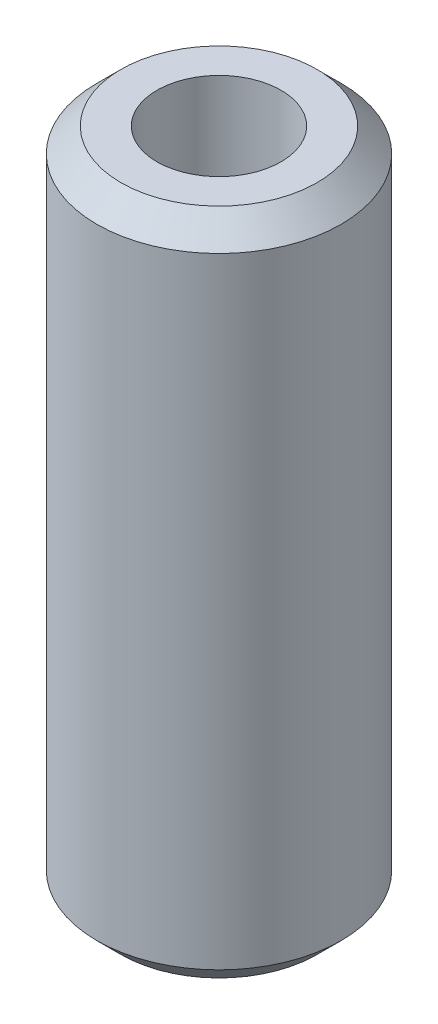
ISO-10303-21;
HEADER;
FILE_DESCRIPTION(('STEP AP214'),'2;1');
FILE_NAME('part.step','',(''),(''),'','','');
FILE_SCHEMA(('AUTOMOTIVE_DESIGN { 1 0 10303 214 1 1 1 1 }'));
ENDSEC;
DATA;
#1=APPLICATION_CONTEXT('core data for automotive mechanical design processes');
#2=APPLICATION_PROTOCOL_DEFINITION('international standard','automotive_design',2000,#1);
#3=PRODUCT_CONTEXT('',#1,'mechanical');
#4=PRODUCT('Part','Part','',(#3));
#5=PRODUCT_RELATED_PRODUCT_CATEGORY('part','',(#4));
#6=PRODUCT_DEFINITION_FORMATION('','',#4);
#7=PRODUCT_DEFINITION_CONTEXT('part definition',#1,'design');
#8=PRODUCT_DEFINITION('design','',#6,#7);
#9=PRODUCT_DEFINITION_SHAPE('','',#8);
#10=(LENGTH_UNIT() NAMED_UNIT(*) SI_UNIT(.MILLI.,.METRE.));
#11=(NAMED_UNIT(*) PLANE_ANGLE_UNIT() SI_UNIT($,.RADIAN.));
#12=(NAMED_UNIT(*) SI_UNIT($,.STERADIAN.) SOLID_ANGLE_UNIT());
#13=UNCERTAINTY_MEASURE_WITH_UNIT(LENGTH_MEASURE(1.E-05),#10,'distance_accuracy_value','');
#14=(GEOMETRIC_REPRESENTATION_CONTEXT(3) GLOBAL_UNCERTAINTY_ASSIGNED_CONTEXT((#13)) GLOBAL_UNIT_ASSIGNED_CONTEXT((#10,
#11,#12)) REPRESENTATION_CONTEXT('',''));
#15=CARTESIAN_POINT('',(0.,0.,0.));
#16=DIRECTION('',(0.,0.,1.));
#17=DIRECTION('',(1.,0.,0.));
#18=AXIS2_PLACEMENT_3D('',#15,#16,#17);
#19=CARTESIAN_POINT('',(0.,32.25,0.));
#20=DIRECTION('',(0.,-1.,0.));
#21=DIRECTION('',(0.,0.,-1.));
#22=AXIS2_PLACEMENT_3D('',#19,#20,#21);
#23=CONICAL_SURFACE('',#22,12.7,0.785398163397442);
#24=CARTESIAN_POINT('',(0.,34.75,0.));
#25=DIRECTION('',(0.,1.,0.));
#26=DIRECTION('',(0.,0.,1.));
#27=AXIS2_PLACEMENT_3D('',#24,#25,#26);
#28=CIRCLE('',#27,10.2);
#29=CARTESIAN_POINT('',(0.,34.75,10.2));
#30=VERTEX_POINT('',#29);
#31=EDGE_CURVE('E10',#30,#30,#28,.T.);
#32=ORIENTED_EDGE('',*,*,#31,.F.);
#33=EDGE_LOOP('',(#32));
#34=FACE_BOUND('',#33,.T.);
#35=CARTESIAN_POINT('',(0.,32.25,0.));
#36=DIRECTION('',(0.,1.,0.));
#37=DIRECTION('',(0.,0.,1.));
#38=AXIS2_PLACEMENT_3D('',#35,#36,#37);
#39=CIRCLE('',#38,12.7);
#40=CARTESIAN_POINT('',(0.,32.25,12.7));
#41=VERTEX_POINT('',#40);
#42=EDGE_CURVE('E57',#41,#41,#39,.T.);
#43=ORIENTED_EDGE('',*,*,#42,.T.);
#44=EDGE_LOOP('',(#43));
#45=FACE_BOUND('',#44,.T.);
#46=ADVANCED_FACE('F35',(#34,#45),#23,.T.);
#47=CARTESIAN_POINT('',(10.2,34.75,0.));
#48=DIRECTION('',(0.,-1.,0.));
#49=DIRECTION('',(0.,0.,-1.));
#50=AXIS2_PLACEMENT_3D('',#47,#48,#49);
#51=PLANE('',#50);
#52=CARTESIAN_POINT('',(0.,34.75,0.));
#53=DIRECTION('',(0.,1.,0.));
#54=DIRECTION('',(0.,0.,1.));
#55=AXIS2_PLACEMENT_3D('',#52,#53,#54);
#56=CIRCLE('',#55,6.45000000000001);
#57=CARTESIAN_POINT('',(0.,34.75,6.45000000000001));
#58=VERTEX_POINT('',#57);
#59=EDGE_CURVE('E41',#58,#58,#56,.T.);
#60=ORIENTED_EDGE('',*,*,#59,.F.);
#61=EDGE_LOOP('',(#60));
#62=FACE_BOUND('',#61,.T.);
#63=ORIENTED_EDGE('',*,*,#31,.T.);
#64=EDGE_LOOP('',(#63));
#65=FACE_BOUND('',#64,.T.);
#66=ADVANCED_FACE('F82',(#62,#65),#51,.F.);
#67=CARTESIAN_POINT('',(0.,78.808165711308,0.));
#68=DIRECTION('',(0.,1.,0.));
#69=DIRECTION('',(0.,0.,1.));
#70=AXIS2_PLACEMENT_3D('',#67,#68,#69);
#71=CYLINDRICAL_SURFACE('',#70,6.45000000000001);
#72=CARTESIAN_POINT('',(0.,-34.75,0.));
#73=DIRECTION('',(0.,1.,0.));
#74=DIRECTION('',(0.,0.,1.));
#75=AXIS2_PLACEMENT_3D('',#72,#73,#74);
#76=CIRCLE('',#75,6.45000000000001);
#77=CARTESIAN_POINT('',(0.,-34.75,6.45000000000001));
#78=VERTEX_POINT('',#77);
#79=EDGE_CURVE('E45',#78,#78,#76,.T.);
#80=ORIENTED_EDGE('',*,*,#79,.F.);
#81=EDGE_LOOP('',(#80));
#82=FACE_BOUND('',#81,.T.);
#83=ORIENTED_EDGE('',*,*,#59,.T.);
#84=EDGE_LOOP('',(#83));
#85=FACE_BOUND('',#84,.T.);
#86=ADVANCED_FACE('F77',(#82,#85),#71,.F.);
#87=CARTESIAN_POINT('',(10.2,-34.75,0.));
#88=DIRECTION('',(0.,1.,0.));
#89=DIRECTION('',(0.,0.,1.));
#90=AXIS2_PLACEMENT_3D('',#87,#88,#89);
#91=PLANE('',#90);
#92=CARTESIAN_POINT('',(0.,-34.75,0.));
#93=DIRECTION('',(0.,1.,0.));
#94=DIRECTION('',(0.,0.,1.));
#95=AXIS2_PLACEMENT_3D('',#92,#93,#94);
#96=CIRCLE('',#95,10.2);
#97=CARTESIAN_POINT('',(0.,-34.75,10.2));
#98=VERTEX_POINT('',#97);
#99=EDGE_CURVE('E49',#98,#98,#96,.T.);
#100=ORIENTED_EDGE('',*,*,#99,.F.);
#101=EDGE_LOOP('',(#100));
#102=FACE_BOUND('',#101,.T.);
#103=ORIENTED_EDGE('',*,*,#79,.T.);
#104=EDGE_LOOP('',(#103));
#105=FACE_BOUND('',#104,.T.);
#106=ADVANCED_FACE('F71',(#102,#105),#91,.F.);
#107=CARTESIAN_POINT('',(0.,-34.75,0.));
#108=DIRECTION('',(0.,1.,0.));
#109=DIRECTION('',(0.,0.,1.));
#110=AXIS2_PLACEMENT_3D('',#107,#108,#109);
#111=CONICAL_SURFACE('',#110,10.2,0.785398163397446);
#112=CARTESIAN_POINT('',(0.,-32.25,0.));
#113=DIRECTION('',(0.,1.,0.));
#114=DIRECTION('',(0.,0.,1.));
#115=AXIS2_PLACEMENT_3D('',#112,#113,#114);
#116=CIRCLE('',#115,12.7);
#117=CARTESIAN_POINT('',(0.,-32.25,12.7));
#118=VERTEX_POINT('',#117);
#119=EDGE_CURVE('E54',#118,#118,#116,.T.);
#120=ORIENTED_EDGE('',*,*,#119,.F.);
#121=EDGE_LOOP('',(#120));
#122=FACE_BOUND('',#121,.T.);
#123=ORIENTED_EDGE('',*,*,#99,.T.);
#124=EDGE_LOOP('',(#123));
#125=FACE_BOUND('',#124,.T.);
#126=ADVANCED_FACE('F65',(#122,#125),#111,.T.);
#127=CARTESIAN_POINT('',(0.,78.808165711308,0.));
#128=DIRECTION('',(0.,1.,0.));
#129=DIRECTION('',(0.,0.,1.));
#130=AXIS2_PLACEMENT_3D('',#127,#128,#129);
#131=CYLINDRICAL_SURFACE('',#130,12.7);
#132=ORIENTED_EDGE('',*,*,#42,.F.);
#133=EDGE_LOOP('',(#132));
#134=FACE_BOUND('',#133,.T.);
#135=ORIENTED_EDGE('',*,*,#119,.T.);
#136=EDGE_LOOP('',(#135));
#137=FACE_BOUND('',#136,.T.);
#138=ADVANCED_FACE('F62',(#134,#137),#131,.T.);
#139=CLOSED_SHELL('',(#46,#66,#86,#106,#126,#138));
#140=MANIFOLD_SOLID_BREP('B2',#139);
#141=ADVANCED_BREP_SHAPE_REPRESENTATION('',(#18,#140),#14);
#142=SHAPE_DEFINITION_REPRESENTATION(#9,#141);
ENDSEC;
END-ISO-10303-21;
